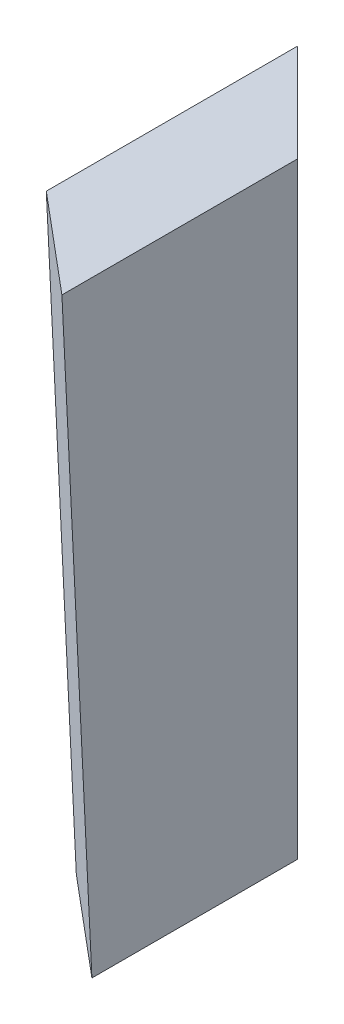
ISO-10303-21;
HEADER;
FILE_DESCRIPTION(('STEP AP214'),'2;1');
FILE_NAME('part.step','',(''),(''),'','','');
FILE_SCHEMA(('AUTOMOTIVE_DESIGN { 1 0 10303 214 1 1 1 1 }'));
ENDSEC;
DATA;
#1=APPLICATION_CONTEXT('core data for automotive mechanical design processes');
#2=APPLICATION_PROTOCOL_DEFINITION('international standard','automotive_design',2000,#1);
#3=PRODUCT_CONTEXT('',#1,'mechanical');
#4=PRODUCT('Part','Part','',(#3));
#5=PRODUCT_RELATED_PRODUCT_CATEGORY('part','',(#4));
#6=PRODUCT_DEFINITION_FORMATION('','',#4);
#7=PRODUCT_DEFINITION_CONTEXT('part definition',#1,'design');
#8=PRODUCT_DEFINITION('design','',#6,#7);
#9=PRODUCT_DEFINITION_SHAPE('','',#8);
#10=(LENGTH_UNIT() NAMED_UNIT(*) SI_UNIT(.MILLI.,.METRE.));
#11=(NAMED_UNIT(*) PLANE_ANGLE_UNIT() SI_UNIT($,.RADIAN.));
#12=(NAMED_UNIT(*) SI_UNIT($,.STERADIAN.) SOLID_ANGLE_UNIT());
#13=UNCERTAINTY_MEASURE_WITH_UNIT(LENGTH_MEASURE(1.E-05),#10,'distance_accuracy_value','');
#14=(GEOMETRIC_REPRESENTATION_CONTEXT(3) GLOBAL_UNCERTAINTY_ASSIGNED_CONTEXT((#13)) GLOBAL_UNIT_ASSIGNED_CONTEXT((#10,
#11,#12)) REPRESENTATION_CONTEXT('',''));
#15=CARTESIAN_POINT('',(0.,0.,0.));
#16=DIRECTION('',(0.,0.,1.));
#17=DIRECTION('',(1.,0.,0.));
#18=AXIS2_PLACEMENT_3D('',#15,#16,#17);
#19=CARTESIAN_POINT('',(0.,0.,0.));
#20=DIRECTION('',(0.,-1.,0.));
#21=DIRECTION('',(0.,0.,-1.));
#22=AXIS2_PLACEMENT_3D('',#19,#20,#21);
#23=PLANE('',#22);
#24=DIRECTION('',(0.,0.,-1.));
#25=VECTOR('',#24,1.);
#26=CARTESIAN_POINT('',(12.4958054915114,0.,12.5074875621891));
#27=LINE('',#26,#25);
#28=CARTESIAN_POINT('',(12.4958054915114,0.,38.8274875621891));
#29=VERTEX_POINT('',#28);
#30=CARTESIAN_POINT('',(12.4958054915114,0.,12.5074875621891));
#31=VERTEX_POINT('',#30);
#32=EDGE_CURVE('E203',#29,#31,#27,.T.);
#33=ORIENTED_EDGE('',*,*,#32,.F.);
#34=DIRECTION('',(0.76567435609751,0.,0.6432284045459));
#35=VECTOR('',#34,1.);
#36=CARTESIAN_POINT('',(12.4958054915114,0.,38.8274875621891));
#37=LINE('',#36,#35);
#38=CARTESIAN_POINT('',(0.,0.,28.33));
#39=VERTEX_POINT('',#38);
#40=EDGE_CURVE('E106',#39,#29,#37,.T.);
#41=ORIENTED_EDGE('',*,*,#40,.F.);
#42=DIRECTION('',(0.,0.,1.));
#43=VECTOR('',#42,1.);
#44=CARTESIAN_POINT('',(0.,0.,28.33));
#45=LINE('',#44,#43);
#46=CARTESIAN_POINT('',(0.,0.,0.));
#47=VERTEX_POINT('',#46);
#48=EDGE_CURVE('E64',#47,#39,#45,.T.);
#49=ORIENTED_EDGE('',*,*,#48,.F.);
#50=DIRECTION('',(-0.706776328705394,0.,-0.707437079309337));
#51=VECTOR('',#50,1.);
#52=CARTESIAN_POINT('',(0.,0.,0.));
#53=LINE('',#52,#51);
#54=EDGE_CURVE('E12',#31,#47,#53,.T.);
#55=ORIENTED_EDGE('',*,*,#54,.F.);
#56=EDGE_LOOP('',(#33,#41,#49,#55));
#57=FACE_BOUND('',#56,.T.);
#58=ADVANCED_FACE('F53',(#57),#23,.T.);
#59=CARTESIAN_POINT('',(0.,75.,0.));
#60=DIRECTION('',(0.,1.,0.));
#61=DIRECTION('',(0.,0.,1.));
#62=AXIS2_PLACEMENT_3D('',#59,#60,#61);
#63=PLANE('',#62);
#64=DIRECTION('',(-0.706776328705396,0.,-0.707437079309335));
#65=VECTOR('',#64,1.);
#66=CARTESIAN_POINT('',(9.87580549151135,75.,9.88748756218907));
#67=LINE('',#66,#65);
#68=CARTESIAN_POINT('',(9.87580549151135,75.,9.88748756218907));
#69=VERTEX_POINT('',#68);
#70=CARTESIAN_POINT('',(-2.62000000000004,75.,-2.61999999999996));
#71=VERTEX_POINT('',#70);
#72=EDGE_CURVE('E170',#69,#71,#67,.T.);
#73=ORIENTED_EDGE('',*,*,#72,.T.);
#74=DIRECTION('',(0.,0.,1.));
#75=VECTOR('',#74,1.);
#76=CARTESIAN_POINT('',(-2.62000000000004,75.,-2.61999999999996));
#77=LINE('',#76,#75);
#78=CARTESIAN_POINT('',(-2.62000000000004,75.,29.55));
#79=VERTEX_POINT('',#78);
#80=EDGE_CURVE('E128',#71,#79,#77,.T.);
#81=ORIENTED_EDGE('',*,*,#80,.T.);
#82=DIRECTION('',(0.765674356097512,0.,0.643228404545897));
#83=VECTOR('',#82,1.);
#84=CARTESIAN_POINT('',(-2.62000000000004,75.,29.55));
#85=LINE('',#84,#83);
#86=CARTESIAN_POINT('',(9.87580549151136,75.,40.0474875621891));
#87=VERTEX_POINT('',#86);
#88=EDGE_CURVE('E102',#79,#87,#85,.T.);
#89=ORIENTED_EDGE('',*,*,#88,.T.);
#90=DIRECTION('',(0.,0.,-1.));
#91=VECTOR('',#90,1.);
#92=CARTESIAN_POINT('',(9.87580549151136,75.,40.0474875621891));
#93=LINE('',#92,#91);
#94=EDGE_CURVE('E113',#87,#69,#93,.T.);
#95=ORIENTED_EDGE('',*,*,#94,.T.);
#96=EDGE_LOOP('',(#73,#81,#89,#95));
#97=FACE_BOUND('',#96,.T.);
#98=ADVANCED_FACE('F127',(#97),#63,.T.);
#99=CARTESIAN_POINT('',(0.,0.,0.));
#100=DIRECTION('',(0.70743707912088,2.30822210916042E-05,-0.706776328517112));
#101=DIRECTION('',(-0.706776328705394,0.,-0.707437079309337));
#102=AXIS2_PLACEMENT_3D('',#99,#100,#101);
#103=PLANE('',#102);
#104=DIRECTION('',(0.0348907807439383,-0.99878189152495,0.0348907807439383));
#105=VECTOR('',#104,1.);
#106=CARTESIAN_POINT('',(9.87580549151135,75.,9.88748756218907));
#107=LINE('',#106,#105);
#108=EDGE_CURVE('E117',#69,#31,#107,.T.);
#109=ORIENTED_EDGE('',*,*,#108,.T.);
#110=ORIENTED_EDGE('',*,*,#54,.T.);
#111=DIRECTION('',(0.0348907807439388,-0.99878189152495,0.0348907807439377));
#112=VECTOR('',#111,1.);
#113=CARTESIAN_POINT('',(-2.62000000000004,75.,-2.61999999999996));
#114=LINE('',#113,#112);
#115=EDGE_CURVE('E79',#71,#47,#114,.T.);
#116=ORIENTED_EDGE('',*,*,#115,.F.);
#117=ORIENTED_EDGE('',*,*,#72,.F.);
#118=EDGE_LOOP('',(#109,#110,#116,#117));
#119=FACE_BOUND('',#118,.T.);
#120=ADVANCED_FACE('F148',(#119),#103,.T.);
#121=CARTESIAN_POINT('',(0.,0.,0.));
#122=DIRECTION('',(-0.999390389002902,-0.0349120375891686,0.));
#123=DIRECTION('',(0.0349120375891686,-0.999390389002902,0.));
#124=AXIS2_PLACEMENT_3D('',#121,#122,#123);
#125=PLANE('',#124);
#126=ORIENTED_EDGE('',*,*,#115,.T.);
#127=ORIENTED_EDGE('',*,*,#48,.T.);
#128=DIRECTION('',(0.0349074251930197,-0.999258354762,-0.0162546025707959));
#129=VECTOR('',#128,1.);
#130=CARTESIAN_POINT('',(-2.62000000000004,75.,29.55));
#131=LINE('',#130,#129);
#132=EDGE_CURVE('E110',#79,#39,#131,.T.);
#133=ORIENTED_EDGE('',*,*,#132,.F.);
#134=ORIENTED_EDGE('',*,*,#80,.F.);
#135=EDGE_LOOP('',(#126,#127,#133,#134));
#136=FACE_BOUND('',#135,.T.);
#137=ADVANCED_FACE('F229',(#136),#125,.T.);
#138=CARTESIAN_POINT('',(12.4805749743817,0.435988085771735,0.));
#139=DIRECTION('',(0.999390389002902,0.0349120375891681,0.));
#140=DIRECTION('',(-0.0349120375891681,0.999390389002903,0.));
#141=AXIS2_PLACEMENT_3D('',#138,#139,#140);
#142=PLANE('',#141);
#143=DIRECTION('',(0.0349074251930192,-0.999258354762,-0.0162546025707952));
#144=VECTOR('',#143,1.);
#145=CARTESIAN_POINT('',(9.87580549151136,75.,40.0474875621891));
#146=LINE('',#145,#144);
#147=EDGE_CURVE('E97',#87,#29,#146,.T.);
#148=ORIENTED_EDGE('',*,*,#147,.T.);
#149=ORIENTED_EDGE('',*,*,#32,.T.);
#150=ORIENTED_EDGE('',*,*,#108,.F.);
#151=ORIENTED_EDGE('',*,*,#94,.F.);
#152=EDGE_LOOP('',(#148,#149,#150,#151));
#153=FACE_BOUND('',#152,.T.);
#154=ADVANCED_FACE('F115',(#153),#142,.T.);
#155=CARTESIAN_POINT('',(-13.9356258608095,-0.756656375188621,16.5884331014952));
#156=DIRECTION('',(-0.642836470489257,-0.0349038011250965,0.765207812869115));
#157=DIRECTION('',(0.76567435609751,0.,0.6432284045459));
#158=AXIS2_PLACEMENT_3D('',#155,#156,#157);
#159=PLANE('',#158);
#160=ORIENTED_EDGE('',*,*,#132,.T.);
#161=ORIENTED_EDGE('',*,*,#40,.T.);
#162=ORIENTED_EDGE('',*,*,#147,.F.);
#163=ORIENTED_EDGE('',*,*,#88,.F.);
#164=EDGE_LOOP('',(#160,#161,#162,#163));
#165=FACE_BOUND('',#164,.T.);
#166=ADVANCED_FACE('F100',(#165),#159,.T.);
#167=CLOSED_SHELL('',(#58,#98,#120,#137,#154,#166));
#168=MANIFOLD_SOLID_BREP('B2',#167);
#169=ADVANCED_BREP_SHAPE_REPRESENTATION('',(#18,#168),#14);
#170=SHAPE_DEFINITION_REPRESENTATION(#9,#169);
ENDSEC;
END-ISO-10303-21;
